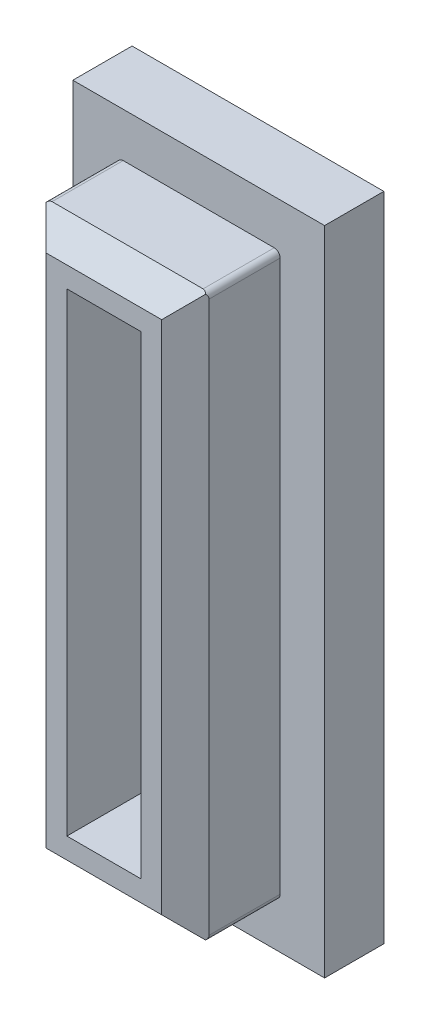
ISO-10303-21;
HEADER;
FILE_DESCRIPTION(('STEP AP214'),'2;1');
FILE_NAME('part.step','',(''),(''),'','','');
FILE_SCHEMA(('AUTOMOTIVE_DESIGN { 1 0 10303 214 1 1 1 1 }'));
ENDSEC;
DATA;
#1=APPLICATION_CONTEXT('core data for automotive mechanical design processes');
#2=APPLICATION_PROTOCOL_DEFINITION('international standard','automotive_design',2000,#1);
#3=PRODUCT_CONTEXT('',#1,'mechanical');
#4=PRODUCT('Part','Part','',(#3));
#5=PRODUCT_RELATED_PRODUCT_CATEGORY('part','',(#4));
#6=PRODUCT_DEFINITION_FORMATION('','',#4);
#7=PRODUCT_DEFINITION_CONTEXT('part definition',#1,'design');
#8=PRODUCT_DEFINITION('design','',#6,#7);
#9=PRODUCT_DEFINITION_SHAPE('','',#8);
#10=(LENGTH_UNIT() NAMED_UNIT(*) SI_UNIT(.MILLI.,.METRE.));
#11=(NAMED_UNIT(*) PLANE_ANGLE_UNIT() SI_UNIT($,.RADIAN.));
#12=(NAMED_UNIT(*) SI_UNIT($,.STERADIAN.) SOLID_ANGLE_UNIT());
#13=UNCERTAINTY_MEASURE_WITH_UNIT(LENGTH_MEASURE(1.E-05),#10,'distance_accuracy_value','');
#14=(GEOMETRIC_REPRESENTATION_CONTEXT(3) GLOBAL_UNCERTAINTY_ASSIGNED_CONTEXT((#13)) GLOBAL_UNIT_ASSIGNED_CONTEXT((#10,
#11,#12)) REPRESENTATION_CONTEXT('',''));
#15=CARTESIAN_POINT('',(0.,0.,0.));
#16=DIRECTION('',(0.,0.,1.));
#17=DIRECTION('',(1.,0.,0.));
#18=AXIS2_PLACEMENT_3D('',#15,#16,#17);
#19=CARTESIAN_POINT('',(-12.7686327088267,2.33540172513786,0.));
#20=DIRECTION('',(0.,0.,1.));
#21=DIRECTION('',(1.,0.,0.));
#22=AXIS2_PLACEMENT_3D('',#19,#20,#21);
#23=PLANE('',#22);
#24=DIRECTION('',(1.,0.,0.));
#25=VECTOR('',#24,1.);
#26=CARTESIAN_POINT('',(-14.0186327088267,-5.66459827486215,0.));
#27=LINE('',#26,#25);
#28=CARTESIAN_POINT('',(-14.0186327088267,-5.66459827486215,0.));
#29=VERTEX_POINT('',#28);
#30=CARTESIAN_POINT('',(-11.5186327088267,-5.66459827486215,0.));
#31=VERTEX_POINT('',#30);
#32=EDGE_CURVE('E254',#29,#31,#27,.T.);
#33=ORIENTED_EDGE('',*,*,#32,.T.);
#34=DIRECTION('',(0.,1.,0.));
#35=VECTOR('',#34,1.);
#36=CARTESIAN_POINT('',(-11.5186327088267,-5.66459827486214,0.));
#37=LINE('',#36,#35);
#38=CARTESIAN_POINT('',(-11.5186327088267,10.3354017251379,0.));
#39=VERTEX_POINT('',#38);
#40=EDGE_CURVE('E255',#31,#39,#37,.T.);
#41=ORIENTED_EDGE('',*,*,#40,.T.);
#42=DIRECTION('',(-1.,0.,0.));
#43=VECTOR('',#42,1.);
#44=CARTESIAN_POINT('',(-11.5186327088267,10.3354017251379,0.));
#45=LINE('',#44,#43);
#46=CARTESIAN_POINT('',(-14.0186327088267,10.3354017251379,0.));
#47=VERTEX_POINT('',#46);
#48=EDGE_CURVE('E234',#39,#47,#45,.T.);
#49=ORIENTED_EDGE('',*,*,#48,.T.);
#50=DIRECTION('',(0.,-1.,0.));
#51=VECTOR('',#50,1.);
#52=CARTESIAN_POINT('',(-14.0186327088267,10.3354017251379,0.));
#53=LINE('',#52,#51);
#54=EDGE_CURVE('E382',#47,#29,#53,.T.);
#55=ORIENTED_EDGE('',*,*,#54,.T.);
#56=EDGE_LOOP('',(#33,#41,#49,#55));
#57=FACE_BOUND('',#56,.T.);
#58=DIRECTION('',(1.,0.,0.));
#59=VECTOR('',#58,1.);
#60=CARTESIAN_POINT('',(-17.0186327088267,-8.66459827486214,0.));
#61=LINE('',#60,#59);
#62=CARTESIAN_POINT('',(-17.0186327088267,-8.66459827486214,0.));
#63=VERTEX_POINT('',#62);
#64=CARTESIAN_POINT('',(-8.51863270882669,-8.66459827486214,0.));
#65=VERTEX_POINT('',#64);
#66=EDGE_CURVE('E11',#63,#65,#61,.T.);
#67=ORIENTED_EDGE('',*,*,#66,.F.);
#68=DIRECTION('',(0.,-1.,0.));
#69=VECTOR('',#68,1.);
#70=CARTESIAN_POINT('',(-17.0186327088267,13.3354017251379,0.));
#71=LINE('',#70,#69);
#72=CARTESIAN_POINT('',(-17.0186327088267,13.3354017251379,0.));
#73=VERTEX_POINT('',#72);
#74=EDGE_CURVE('E386',#73,#63,#71,.T.);
#75=ORIENTED_EDGE('',*,*,#74,.F.);
#76=DIRECTION('',(-1.,0.,0.));
#77=VECTOR('',#76,1.);
#78=CARTESIAN_POINT('',(-8.51863270882669,13.3354017251379,0.));
#79=LINE('',#78,#77);
#80=CARTESIAN_POINT('',(-8.51863270882669,13.3354017251379,0.));
#81=VERTEX_POINT('',#80);
#82=EDGE_CURVE('E366',#81,#73,#79,.T.);
#83=ORIENTED_EDGE('',*,*,#82,.F.);
#84=DIRECTION('',(0.,1.,0.));
#85=VECTOR('',#84,1.);
#86=CARTESIAN_POINT('',(-8.51863270882669,-8.66459827486214,0.));
#87=LINE('',#86,#85);
#88=EDGE_CURVE('E25',#65,#81,#87,.T.);
#89=ORIENTED_EDGE('',*,*,#88,.F.);
#90=EDGE_LOOP('',(#67,#75,#83,#89));
#91=FACE_BOUND('',#90,.T.);
#92=ADVANCED_FACE('F17',(#57,#91),#23,.F.);
#93=CARTESIAN_POINT('',(-8.51863270882669,-8.66459827486214,0.));
#94=DIRECTION('',(0.,-1.,0.));
#95=DIRECTION('',(0.,0.,-1.));
#96=AXIS2_PLACEMENT_3D('',#93,#94,#95);
#97=PLANE('',#96);
#98=DIRECTION('',(-1.,0.,0.));
#99=VECTOR('',#98,1.);
#100=CARTESIAN_POINT('',(-8.51863270882669,-8.66459827486214,2.));
#101=LINE('',#100,#99);
#102=CARTESIAN_POINT('',(-8.51863270882669,-8.66459827486214,2.));
#103=VERTEX_POINT('',#102);
#104=CARTESIAN_POINT('',(-17.0186327088267,-8.66459827486214,2.));
#105=VERTEX_POINT('',#104);
#106=EDGE_CURVE('E297',#103,#105,#101,.T.);
#107=ORIENTED_EDGE('',*,*,#106,.T.);
#108=DIRECTION('',(0.,0.,1.));
#109=VECTOR('',#108,1.);
#110=CARTESIAN_POINT('',(-17.0186327088267,-8.66459827486214,0.));
#111=LINE('',#110,#109);
#112=EDGE_CURVE('E409',#63,#105,#111,.T.);
#113=ORIENTED_EDGE('',*,*,#112,.F.);
#114=ORIENTED_EDGE('',*,*,#66,.T.);
#115=DIRECTION('',(0.,0.,1.));
#116=VECTOR('',#115,1.);
#117=CARTESIAN_POINT('',(-8.51863270882669,-8.66459827486214,0.));
#118=LINE('',#117,#116);
#119=EDGE_CURVE('E369',#65,#103,#118,.T.);
#120=ORIENTED_EDGE('',*,*,#119,.T.);
#121=EDGE_LOOP('',(#107,#113,#114,#120));
#122=FACE_BOUND('',#121,.T.);
#123=ADVANCED_FACE('F801',(#122),#97,.T.);
#124=CARTESIAN_POINT('',(-8.51863270882669,13.3354017251379,0.));
#125=DIRECTION('',(1.,0.,0.));
#126=DIRECTION('',(0.,1.,0.));
#127=AXIS2_PLACEMENT_3D('',#124,#125,#126);
#128=PLANE('',#127);
#129=DIRECTION('',(0.,-1.,0.));
#130=VECTOR('',#129,1.);
#131=CARTESIAN_POINT('',(-8.51863270882669,13.3354017251379,2.));
#132=LINE('',#131,#130);
#133=CARTESIAN_POINT('',(-8.51863270882669,13.3354017251379,2.));
#134=VERTEX_POINT('',#133);
#135=EDGE_CURVE('E301',#134,#103,#132,.T.);
#136=ORIENTED_EDGE('',*,*,#135,.T.);
#137=ORIENTED_EDGE('',*,*,#119,.F.);
#138=ORIENTED_EDGE('',*,*,#88,.T.);
#139=DIRECTION('',(0.,0.,1.));
#140=VECTOR('',#139,1.);
#141=CARTESIAN_POINT('',(-8.51863270882669,13.3354017251379,0.));
#142=LINE('',#141,#140);
#143=EDGE_CURVE('E370',#81,#134,#142,.T.);
#144=ORIENTED_EDGE('',*,*,#143,.T.);
#145=EDGE_LOOP('',(#136,#137,#138,#144));
#146=FACE_BOUND('',#145,.T.);
#147=ADVANCED_FACE('F792',(#146),#128,.T.);
#148=CARTESIAN_POINT('',(-17.0186327088267,13.3354017251379,0.));
#149=DIRECTION('',(0.,1.,0.));
#150=DIRECTION('',(1.,0.,0.));
#151=AXIS2_PLACEMENT_3D('',#148,#149,#150);
#152=PLANE('',#151);
#153=DIRECTION('',(1.,0.,0.));
#154=VECTOR('',#153,1.);
#155=CARTESIAN_POINT('',(-17.0186327088267,13.3354017251379,2.));
#156=LINE('',#155,#154);
#157=CARTESIAN_POINT('',(-17.0186327088267,13.3354017251379,2.));
#158=VERTEX_POINT('',#157);
#159=EDGE_CURVE('E363',#158,#134,#156,.T.);
#160=ORIENTED_EDGE('',*,*,#159,.T.);
#161=ORIENTED_EDGE('',*,*,#143,.F.);
#162=ORIENTED_EDGE('',*,*,#82,.T.);
#163=DIRECTION('',(0.,0.,1.));
#164=VECTOR('',#163,1.);
#165=CARTESIAN_POINT('',(-17.0186327088267,13.3354017251379,0.));
#166=LINE('',#165,#164);
#167=EDGE_CURVE('E383',#73,#158,#166,.T.);
#168=ORIENTED_EDGE('',*,*,#167,.T.);
#169=EDGE_LOOP('',(#160,#161,#162,#168));
#170=FACE_BOUND('',#169,.T.);
#171=ADVANCED_FACE('F783',(#170),#152,.T.);
#172=CARTESIAN_POINT('',(-17.0186327088267,-8.66459827486214,0.));
#173=DIRECTION('',(-1.,0.,0.));
#174=DIRECTION('',(0.,0.,1.));
#175=AXIS2_PLACEMENT_3D('',#172,#173,#174);
#176=PLANE('',#175);
#177=DIRECTION('',(0.,1.,0.));
#178=VECTOR('',#177,1.);
#179=CARTESIAN_POINT('',(-17.0186327088267,-8.66459827486214,2.));
#180=LINE('',#179,#178);
#181=EDGE_CURVE('E249',#105,#158,#180,.T.);
#182=ORIENTED_EDGE('',*,*,#181,.T.);
#183=ORIENTED_EDGE('',*,*,#167,.F.);
#184=ORIENTED_EDGE('',*,*,#74,.T.);
#185=ORIENTED_EDGE('',*,*,#112,.T.);
#186=EDGE_LOOP('',(#182,#183,#184,#185));
#187=FACE_BOUND('',#186,.T.);
#188=ADVANCED_FACE('F774',(#187),#176,.T.);
#189=CARTESIAN_POINT('',(-12.7686327088267,2.33540172513786,2.));
#190=DIRECTION('',(0.,0.,1.));
#191=DIRECTION('',(1.,0.,0.));
#192=AXIS2_PLACEMENT_3D('',#189,#190,#191);
#193=PLANE('',#192);
#194=DIRECTION('',(0.,1.,0.));
#195=VECTOR('',#194,1.);
#196=CARTESIAN_POINT('',(-15.5186327088267,-6.96459827486214,2.));
#197=LINE('',#196,#195);
#198=CARTESIAN_POINT('',(-15.5186327088267,-6.96459827486214,2.));
#199=VERTEX_POINT('',#198);
#200=CARTESIAN_POINT('',(-15.5186327088267,11.6354017251379,2.));
#201=VERTEX_POINT('',#200);
#202=EDGE_CURVE('E357',#199,#201,#197,.T.);
#203=ORIENTED_EDGE('',*,*,#202,.T.);
#204=CARTESIAN_POINT('',(-15.3186327088267,11.6354017251379,2.));
#205=DIRECTION('',(0.,0.,-1.));
#206=DIRECTION('',(0.,1.,0.));
#207=AXIS2_PLACEMENT_3D('',#204,#205,#206);
#208=CIRCLE('',#207,0.2);
#209=CARTESIAN_POINT('',(-15.3186327088267,11.8354017251378,2.));
#210=VERTEX_POINT('',#209);
#211=EDGE_CURVE('E323',#201,#210,#208,.T.);
#212=ORIENTED_EDGE('',*,*,#211,.T.);
#213=DIRECTION('',(1.,-4.412331E-12,0.));
#214=VECTOR('',#213,1.);
#215=CARTESIAN_POINT('',(-15.3186327088267,11.8354017251378,2.));
#216=LINE('',#215,#214);
#217=CARTESIAN_POINT('',(-10.2186327088267,11.8354017251153,2.));
#218=VERTEX_POINT('',#217);
#219=EDGE_CURVE('E250',#210,#218,#216,.T.);
#220=ORIENTED_EDGE('',*,*,#219,.T.);
#221=CARTESIAN_POINT('',(-10.2186327087862,11.6354017250974,2.));
#222=DIRECTION('',(0.,0.,-1.));
#223=DIRECTION('',(1.,2.023048E-10,0.));
#224=AXIS2_PLACEMENT_3D('',#221,#222,#223);
#225=CIRCLE('',#224,0.200000000017937);
#226=CARTESIAN_POINT('',(-10.0186327087683,11.6354017251379,2.));
#227=VERTEX_POINT('',#226);
#228=EDGE_CURVE('E207',#218,#227,#225,.T.);
#229=ORIENTED_EDGE('',*,*,#228,.T.);
#230=DIRECTION('',(-3.14014E-12,-1.,0.));
#231=VECTOR('',#230,1.);
#232=CARTESIAN_POINT('',(-10.0186327087683,11.6354017251379,2.));
#233=LINE('',#232,#231);
#234=CARTESIAN_POINT('',(-10.0186327088267,-6.96459827486214,2.));
#235=VERTEX_POINT('',#234);
#236=EDGE_CURVE('E202',#227,#235,#233,.T.);
#237=ORIENTED_EDGE('',*,*,#236,.T.);
#238=CARTESIAN_POINT('',(-10.2186327088267,-6.96459827486214,2.));
#239=DIRECTION('',(0.,0.,-1.));
#240=DIRECTION('',(0.,-1.,0.));
#241=AXIS2_PLACEMENT_3D('',#238,#239,#240);
#242=CIRCLE('',#241,0.199999999999989);
#243=CARTESIAN_POINT('',(-10.2186327088267,-7.16459827486213,2.));
#244=VERTEX_POINT('',#243);
#245=EDGE_CURVE('E245',#235,#244,#242,.T.);
#246=ORIENTED_EDGE('',*,*,#245,.T.);
#247=DIRECTION('',(-1.,0.,0.));
#248=VECTOR('',#247,1.);
#249=CARTESIAN_POINT('',(-10.2186327088267,-7.16459827486213,2.));
#250=LINE('',#249,#248);
#251=CARTESIAN_POINT('',(-15.3186327088267,-7.16459827486213,2.));
#252=VERTEX_POINT('',#251);
#253=EDGE_CURVE('E246',#244,#252,#250,.T.);
#254=ORIENTED_EDGE('',*,*,#253,.T.);
#255=CARTESIAN_POINT('',(-15.3186327086993,-6.96459827473478,2.));
#256=DIRECTION('',(0.,0.,-1.));
#257=DIRECTION('',(-1.,-6.368128E-10,0.));
#258=AXIS2_PLACEMENT_3D('',#255,#256,#257);
#259=CIRCLE('',#258,0.200000000127359);
#260=EDGE_CURVE('E265',#252,#199,#259,.T.);
#261=ORIENTED_EDGE('',*,*,#260,.T.);
#262=EDGE_LOOP('',(#203,#212,#220,#229,#237,#246,#254,#261));
#263=FACE_BOUND('',#262,.T.);
#264=ORIENTED_EDGE('',*,*,#181,.F.);
#265=ORIENTED_EDGE('',*,*,#106,.F.);
#266=ORIENTED_EDGE('',*,*,#135,.F.);
#267=ORIENTED_EDGE('',*,*,#159,.F.);
#268=EDGE_LOOP('',(#264,#265,#266,#267));
#269=FACE_BOUND('',#268,.T.);
#270=ADVANCED_FACE('F765',(#263,#269),#193,.T.);
#271=CARTESIAN_POINT('',(-10.2186327088267,-7.16459827486213,2.));
#272=DIRECTION('',(0.,-1.,0.));
#273=DIRECTION('',(0.,0.,-1.));
#274=AXIS2_PLACEMENT_3D('',#271,#272,#273);
#275=PLANE('',#274);
#276=DIRECTION('',(-1.,0.,-3.150769E-12));
#277=VECTOR('',#276,1.);
#278=CARTESIAN_POINT('',(-10.2186327088273,-7.16459827486213,4.40007018992266));
#279=LINE('',#278,#277);
#280=CARTESIAN_POINT('',(-10.2186327088273,-7.16459827486213,4.40007018992266));
#281=VERTEX_POINT('',#280);
#282=CARTESIAN_POINT('',(-15.3186327086999,-7.16459827484612,4.40007018992266));
#283=VERTEX_POINT('',#282);
#284=EDGE_CURVE('E349',#281,#283,#279,.T.);
#285=ORIENTED_EDGE('',*,*,#284,.T.);
#286=DIRECTION('',(0.,0.,1.));
#287=VECTOR('',#286,1.);
#288=CARTESIAN_POINT('',(-15.3186327088267,-7.16459827486213,2.));
#289=LINE('',#288,#287);
#290=EDGE_CURVE('E268',#252,#283,#289,.T.);
#291=ORIENTED_EDGE('',*,*,#290,.F.);
#292=ORIENTED_EDGE('',*,*,#253,.F.);
#293=DIRECTION('',(0.,0.,1.));
#294=VECTOR('',#293,1.);
#295=CARTESIAN_POINT('',(-10.2186327088267,-7.16459827486213,2.));
#296=LINE('',#295,#294);
#297=EDGE_CURVE('E293',#244,#281,#296,.T.);
#298=ORIENTED_EDGE('',*,*,#297,.T.);
#299=EDGE_LOOP('',(#285,#291,#292,#298));
#300=FACE_BOUND('',#299,.T.);
#301=ADVANCED_FACE('F713',(#300),#275,.T.);
#302=CARTESIAN_POINT('',(-15.3186327088267,11.8354017251378,2.));
#303=DIRECTION('',(4.412157E-12,1.,0.));
#304=DIRECTION('',(1.,-4.412157E-12,0.));
#305=AXIS2_PLACEMENT_3D('',#302,#303,#304);
#306=PLANE('',#305);
#307=DIRECTION('',(1.,-4.411983E-12,1.267831E-12));
#308=VECTOR('',#307,1.);
#309=CARTESIAN_POINT('',(-15.318632708826,11.8354017251378,4.40111772727568));
#310=LINE('',#309,#308);
#311=CARTESIAN_POINT('',(-15.318632708826,11.8354017251378,4.40111772727568));
#312=VERTEX_POINT('',#311);
#313=CARTESIAN_POINT('',(-10.2186327087856,11.8354017251218,4.40111772727568));
#314=VERTEX_POINT('',#313);
#315=EDGE_CURVE('E208',#312,#314,#310,.T.);
#316=ORIENTED_EDGE('',*,*,#315,.T.);
#317=DIRECTION('',(0.,0.,1.));
#318=VECTOR('',#317,1.);
#319=CARTESIAN_POINT('',(-10.2186327088267,11.8354017251153,2.));
#320=LINE('',#319,#318);
#321=EDGE_CURVE('E373',#218,#314,#320,.T.);
#322=ORIENTED_EDGE('',*,*,#321,.F.);
#323=ORIENTED_EDGE('',*,*,#219,.F.);
#324=DIRECTION('',(0.,0.,1.));
#325=VECTOR('',#324,1.);
#326=CARTESIAN_POINT('',(-15.3186327088267,11.8354017251378,2.));
#327=LINE('',#326,#325);
#328=EDGE_CURVE('E317',#210,#312,#327,.T.);
#329=ORIENTED_EDGE('',*,*,#328,.T.);
#330=EDGE_LOOP('',(#316,#322,#323,#329));
#331=FACE_BOUND('',#330,.T.);
#332=ADVANCED_FACE('F708',(#331),#306,.T.);
#333=CARTESIAN_POINT('',(-11.5186327088267,-5.66459827486215,2.));
#334=DIRECTION('',(0.,-1.,0.));
#335=DIRECTION('',(0.,0.,-1.));
#336=AXIS2_PLACEMENT_3D('',#333,#334,#335);
#337=PLANE('',#336);
#338=DIRECTION('',(-1.,0.,0.));
#339=VECTOR('',#338,1.);
#340=CARTESIAN_POINT('',(-11.5186327088267,-5.66459827486215,5.2));
#341=LINE('',#340,#339);
#342=CARTESIAN_POINT('',(-11.5186327088267,-5.66459827486215,5.2));
#343=VERTEX_POINT('',#342);
#344=CARTESIAN_POINT('',(-14.0186327088267,-5.66459827486215,5.2));
#345=VERTEX_POINT('',#344);
#346=EDGE_CURVE('E312',#343,#345,#341,.T.);
#347=ORIENTED_EDGE('',*,*,#346,.F.);
#348=DIRECTION('',(0.,0.,1.));
#349=VECTOR('',#348,1.);
#350=CARTESIAN_POINT('',(-11.5186327088267,-5.66459827486215,0.));
#351=LINE('',#350,#349);
#352=EDGE_CURVE('E251',#31,#343,#351,.T.);
#353=ORIENTED_EDGE('',*,*,#352,.F.);
#354=ORIENTED_EDGE('',*,*,#32,.F.);
#355=DIRECTION('',(0.,0.,-1.));
#356=VECTOR('',#355,1.);
#357=CARTESIAN_POINT('',(-14.0186327088267,-5.66459827486215,5.2));
#358=LINE('',#357,#356);
#359=EDGE_CURVE('E378',#345,#29,#358,.T.);
#360=ORIENTED_EDGE('',*,*,#359,.F.);
#361=EDGE_LOOP('',(#347,#353,#354,#360));
#362=FACE_BOUND('',#361,.T.);
#363=ADVANCED_FACE('F687',(#362),#337,.F.);
#364=CARTESIAN_POINT('',(-11.5186327088267,10.3354017251379,2.));
#365=DIRECTION('',(1.,0.,0.));
#366=DIRECTION('',(0.,1.,0.));
#367=AXIS2_PLACEMENT_3D('',#364,#365,#366);
#368=PLANE('',#367);
#369=DIRECTION('',(0.,-1.,0.));
#370=VECTOR('',#369,1.);
#371=CARTESIAN_POINT('',(-11.5186327088267,10.3354017251379,5.2));
#372=LINE('',#371,#370);
#373=CARTESIAN_POINT('',(-11.5186327088267,10.3354017251379,5.2));
#374=VERTEX_POINT('',#373);
#375=EDGE_CURVE('E308',#374,#343,#372,.T.);
#376=ORIENTED_EDGE('',*,*,#375,.F.);
#377=DIRECTION('',(0.,0.,1.));
#378=VECTOR('',#377,1.);
#379=CARTESIAN_POINT('',(-11.5186327088267,10.3354017251379,0.));
#380=LINE('',#379,#378);
#381=EDGE_CURVE('E389',#39,#374,#380,.T.);
#382=ORIENTED_EDGE('',*,*,#381,.F.);
#383=ORIENTED_EDGE('',*,*,#40,.F.);
#384=ORIENTED_EDGE('',*,*,#352,.T.);
#385=EDGE_LOOP('',(#376,#382,#383,#384));
#386=FACE_BOUND('',#385,.T.);
#387=ADVANCED_FACE('F681',(#386),#368,.F.);
#388=CARTESIAN_POINT('',(-14.0186327088267,10.3354017251379,2.));
#389=DIRECTION('',(0.,1.,0.));
#390=DIRECTION('',(1.,0.,0.));
#391=AXIS2_PLACEMENT_3D('',#388,#389,#390);
#392=PLANE('',#391);
#393=DIRECTION('',(1.,0.,0.));
#394=VECTOR('',#393,1.);
#395=CARTESIAN_POINT('',(-14.0186327088267,10.3354017251379,5.2));
#396=LINE('',#395,#394);
#397=CARTESIAN_POINT('',(-14.0186327088267,10.3354017251379,5.2));
#398=VERTEX_POINT('',#397);
#399=EDGE_CURVE('E313',#398,#374,#396,.T.);
#400=ORIENTED_EDGE('',*,*,#399,.F.);
#401=DIRECTION('',(0.,0.,1.));
#402=VECTOR('',#401,1.);
#403=CARTESIAN_POINT('',(-14.0186327088267,10.3354017251379,0.));
#404=LINE('',#403,#402);
#405=EDGE_CURVE('E393',#47,#398,#404,.T.);
#406=ORIENTED_EDGE('',*,*,#405,.F.);
#407=ORIENTED_EDGE('',*,*,#48,.F.);
#408=ORIENTED_EDGE('',*,*,#381,.T.);
#409=EDGE_LOOP('',(#400,#406,#407,#408));
#410=FACE_BOUND('',#409,.T.);
#411=ADVANCED_FACE('F686',(#410),#392,.F.);
#412=CARTESIAN_POINT('',(-14.0186327088267,-5.66459827486215,2.));
#413=DIRECTION('',(-1.,0.,0.));
#414=DIRECTION('',(0.,0.,1.));
#415=AXIS2_PLACEMENT_3D('',#412,#413,#414);
#416=PLANE('',#415);
#417=DIRECTION('',(0.,1.,0.));
#418=VECTOR('',#417,1.);
#419=CARTESIAN_POINT('',(-14.0186327088267,-5.66459827486214,5.2));
#420=LINE('',#419,#418);
#421=EDGE_CURVE('E336',#345,#398,#420,.T.);
#422=ORIENTED_EDGE('',*,*,#421,.F.);
#423=ORIENTED_EDGE('',*,*,#359,.T.);
#424=ORIENTED_EDGE('',*,*,#54,.F.);
#425=ORIENTED_EDGE('',*,*,#405,.T.);
#426=EDGE_LOOP('',(#422,#423,#424,#425));
#427=FACE_BOUND('',#426,.T.);
#428=ADVANCED_FACE('F736',(#427),#416,.F.);
#429=CARTESIAN_POINT('',(-10.0186327087683,11.6354017251379,2.));
#430=DIRECTION('',(1.,-3.14014E-12,0.));
#431=DIRECTION('',(-3.14014E-12,-1.,0.));
#432=AXIS2_PLACEMENT_3D('',#429,#430,#431);
#433=PLANE('',#432);
#434=DIRECTION('',(-3.14014E-12,-1.,3.14014E-12));
#435=VECTOR('',#434,1.);
#436=CARTESIAN_POINT('',(-10.0186327087683,11.6354017250974,4.39999999994162));
#437=LINE('',#436,#435);
#438=CARTESIAN_POINT('',(-10.0186327088267,11.6354017250974,4.4));
#439=VERTEX_POINT('',#438);
#440=CARTESIAN_POINT('',(-10.0186327088267,-6.96459827486214,4.4));
#441=VERTEX_POINT('',#440);
#442=EDGE_CURVE('E200',#439,#441,#437,.T.);
#443=ORIENTED_EDGE('',*,*,#442,.T.);
#444=DIRECTION('',(0.,0.,1.));
#445=VECTOR('',#444,1.);
#446=CARTESIAN_POINT('',(-10.0186327088267,-6.96459827486214,2.));
#447=LINE('',#446,#445);
#448=EDGE_CURVE('E241',#235,#441,#447,.T.);
#449=ORIENTED_EDGE('',*,*,#448,.F.);
#450=ORIENTED_EDGE('',*,*,#236,.F.);
#451=DIRECTION('',(0.,0.,1.));
#452=VECTOR('',#451,1.);
#453=CARTESIAN_POINT('',(-10.0186327087683,11.6354017251379,2.));
#454=LINE('',#453,#452);
#455=EDGE_CURVE('E195',#227,#439,#454,.T.);
#456=ORIENTED_EDGE('',*,*,#455,.T.);
#457=EDGE_LOOP('',(#443,#449,#450,#456));
#458=FACE_BOUND('',#457,.T.);
#459=ADVANCED_FACE('F197',(#458),#433,.T.);
#460=CARTESIAN_POINT('',(-10.2186327087862,11.6354017250974,2.));
#461=DIRECTION('',(0.,0.,1.));
#462=DIRECTION('',(1.,2.023048E-10,0.));
#463=AXIS2_PLACEMENT_3D('',#460,#461,#462);
#464=CYLINDRICAL_SURFACE('',#463,0.200000000017937);
#465=CARTESIAN_POINT('',(-10.2186327087862,11.6354017250974,4.59999999995956));
#466=DIRECTION('',(-0.707106781186527,0.,-0.707106781186568));
#467=DIRECTION('',(0.707106781186568,1.430511E-10,-0.707106781186527));
#468=AXIS2_PLACEMENT_3D('',#465,#466,#467);
#469=ELLIPSE('',#468,0.282842712499977,0.200000000017937);
#470=CARTESIAN_POINT('',(-10.0776739274737,11.7772841481595,4.45904121864709));
#471=VERTEX_POINT('',#470);
#472=EDGE_CURVE('E211',#471,#439,#469,.T.);
#473=ORIENTED_EDGE('',*,*,#472,.T.);
#474=ORIENTED_EDGE('',*,*,#455,.F.);
#475=ORIENTED_EDGE('',*,*,#228,.F.);
#476=ORIENTED_EDGE('',*,*,#321,.T.);
#477=CARTESIAN_POINT('',(-10.2186327087862,11.6354017250974,4.60044982061638));
#478=DIRECTION('',(-2.216693E-12,-0.705923115633426,-0.708288468644236));
#479=DIRECTION('',(-1.432902E-10,0.708288468644236,-0.705923115633426));
#480=AXIS2_PLACEMENT_3D('',#477,#478,#479);
#481=ELLIPSE('',#480,0.28237082611378,0.200000000017937);
#482=EDGE_CURVE('E214',#314,#471,#481,.T.);
#483=ORIENTED_EDGE('',*,*,#482,.T.);
#484=EDGE_LOOP('',(#473,#474,#475,#476,#483));
#485=FACE_BOUND('',#484,.T.);
#486=ADVANCED_FACE('F212',(#485),#464,.T.);
#487=CARTESIAN_POINT('',(-10.0186327087702,11.0338426189752,5.2));
#488=DIRECTION('',(-2.216693E-12,-0.705923115633426,-0.708288468644236));
#489=DIRECTION('',(0.,-0.708288468644236,0.705923115633426));
#490=AXIS2_PLACEMENT_3D('',#487,#488,#489);
#491=PLANE('',#490);
#492=DIRECTION('',(0.576705423801894,0.578637804083864,-0.576705423801859));
#493=VECTOR('',#492,1.);
#494=CARTESIAN_POINT('',(-10.8186327088267,11.0338426189777,5.2));
#495=LINE('',#494,#493);
#496=CARTESIAN_POINT('',(-10.8186327088267,11.0338426189777,5.2));
#497=VERTEX_POINT('',#496);
#498=EDGE_CURVE('E219',#497,#471,#495,.T.);
#499=ORIENTED_EDGE('',*,*,#498,.T.);
#500=ORIENTED_EDGE('',*,*,#482,.F.);
#501=ORIENTED_EDGE('',*,*,#315,.F.);
#502=CARTESIAN_POINT('',(-15.3186327088267,11.6354017251379,4.60044982059201));
#503=DIRECTION('',(-2.216693E-12,-0.705923115633426,-0.708288468644236));
#504=DIRECTION('',(0.,0.708288468644236,-0.705923115633426));
#505=AXIS2_PLACEMENT_3D('',#502,#503,#504);
#506=ELLIPSE('',#505,0.282370826088456,0.2);
#507=CARTESIAN_POINT('',(-15.459591490166,11.7772841481627,4.45904121866072));
#508=VERTEX_POINT('',#507);
#509=EDGE_CURVE('E244',#508,#312,#506,.T.);
#510=ORIENTED_EDGE('',*,*,#509,.F.);
#511=DIRECTION('',(0.576705423800663,-0.578637804086284,0.576705423800662));
#512=VECTOR('',#511,1.);
#513=CARTESIAN_POINT('',(-15.459591490166,11.7772841481627,4.45904121866072));
#514=LINE('',#513,#512);
#515=CARTESIAN_POINT('',(-14.7186327088267,11.0338426189899,5.2));
#516=VERTEX_POINT('',#515);
#517=EDGE_CURVE('E260',#508,#516,#514,.T.);
#518=ORIENTED_EDGE('',*,*,#517,.T.);
#519=DIRECTION('',(-1.,3.140052E-12,0.));
#520=VECTOR('',#519,1.);
#521=CARTESIAN_POINT('',(-10.8186327088267,11.0338426189777,5.2));
#522=LINE('',#521,#520);
#523=EDGE_CURVE('E330',#497,#516,#522,.T.);
#524=ORIENTED_EDGE('',*,*,#523,.F.);
#525=EDGE_LOOP('',(#499,#500,#501,#510,#518,#524));
#526=FACE_BOUND('',#525,.T.);
#527=ADVANCED_FACE('F635',(#526),#491,.F.);
#528=CARTESIAN_POINT('',(-15.5186327088267,-6.96459827486214,2.));
#529=DIRECTION('',(-1.,0.,0.));
#530=DIRECTION('',(0.,0.,1.));
#531=AXIS2_PLACEMENT_3D('',#528,#529,#530);
#532=PLANE('',#531);
#533=DIRECTION('',(0.,1.,0.));
#534=VECTOR('',#533,1.);
#535=CARTESIAN_POINT('',(-15.5186327088267,-6.96459827473478,4.4));
#536=LINE('',#535,#534);
#537=CARTESIAN_POINT('',(-15.5186327088266,-6.96459827473478,4.4));
#538=VERTEX_POINT('',#537);
#539=CARTESIAN_POINT('',(-15.5186327088266,11.6354017251379,4.4));
#540=VERTEX_POINT('',#539);
#541=EDGE_CURVE('E236',#538,#540,#536,.T.);
#542=ORIENTED_EDGE('',*,*,#541,.T.);
#543=DIRECTION('',(0.,0.,1.));
#544=VECTOR('',#543,1.);
#545=CARTESIAN_POINT('',(-15.5186327088267,11.6354017251379,2.));
#546=LINE('',#545,#544);
#547=EDGE_CURVE('E327',#201,#540,#546,.T.);
#548=ORIENTED_EDGE('',*,*,#547,.F.);
#549=ORIENTED_EDGE('',*,*,#202,.F.);
#550=DIRECTION('',(0.,0.,1.));
#551=VECTOR('',#550,1.);
#552=CARTESIAN_POINT('',(-15.5186327088267,-6.96459827486214,2.));
#553=LINE('',#552,#551);
#554=EDGE_CURVE('E269',#199,#538,#553,.T.);
#555=ORIENTED_EDGE('',*,*,#554,.T.);
#556=EDGE_LOOP('',(#542,#548,#549,#555));
#557=FACE_BOUND('',#556,.T.);
#558=ADVANCED_FACE('F657',(#557),#532,.T.);
#559=CARTESIAN_POINT('',(-15.3186327086993,-6.96459827473478,2.));
#560=DIRECTION('',(0.,0.,1.));
#561=DIRECTION('',(-1.,-6.368128E-10,0.));
#562=AXIS2_PLACEMENT_3D('',#559,#560,#561);
#563=CYLINDRICAL_SURFACE('',#562,0.200000000127359);
#564=CARTESIAN_POINT('',(-15.3186327086993,-6.96459827473478,4.60000000012734));
#565=DIRECTION('',(0.707106781186548,0.,-0.707106781186548));
#566=DIRECTION('',(-0.707106781186548,-4.502947E-10,-0.707106781186548));
#567=AXIS2_PLACEMENT_3D('',#564,#565,#566);
#568=ELLIPSE('',#567,0.282842712654731,0.200000000127359);
#569=CARTESIAN_POINT('',(-15.4599209898259,-7.10615258111363,4.45871171900076));
#570=VERTEX_POINT('',#569);
#571=EDGE_CURVE('E238',#570,#538,#568,.T.);
#572=ORIENTED_EDGE('',*,*,#571,.T.);
#573=ORIENTED_EDGE('',*,*,#554,.F.);
#574=ORIENTED_EDGE('',*,*,#260,.F.);
#575=ORIENTED_EDGE('',*,*,#290,.T.);
#576=CARTESIAN_POINT('',(-15.3186327086993,-6.96459827473478,4.60074033468849));
#577=DIRECTION('',(2.22411999999997E-12,0.708288468644236,-0.705923115633426));
#578=DIRECTION('',(4.495409E-10,-0.705923115633426,-0.708288468644236));
#579=AXIS2_PLACEMENT_3D('',#576,#577,#578);
#580=ELLIPSE('',#579,0.283316972766784,0.200000000127359);
#581=EDGE_CURVE('E346',#283,#570,#580,.T.);
#582=ORIENTED_EDGE('',*,*,#581,.T.);
#583=EDGE_LOOP('',(#572,#573,#574,#575,#582));
#584=FACE_BOUND('',#583,.T.);
#585=ADVANCED_FACE('F675',(#584),#563,.T.);
#586=CARTESIAN_POINT('',(-10.0186327088273,-7.16459827486276,4.40007018992266));
#587=DIRECTION('',(2.22412E-12,0.708288468644236,-0.705923115633426));
#588=DIRECTION('',(-1.,0.,-3.15065472534399E-12));
#589=AXIS2_PLACEMENT_3D('',#586,#587,#588);
#590=PLANE('',#589);
#591=DIRECTION('',(-0.577992961099134,0.576062734291803,0.577992961099101));
#592=VECTOR('',#591,1.);
#593=CARTESIAN_POINT('',(-10.0773444277757,-7.10615258118208,4.45871171894904));
#594=LINE('',#593,#592);
#595=CARTESIAN_POINT('',(-10.0773444277757,-7.10615258118208,4.45871171894904));
#596=VERTEX_POINT('',#595);
#597=CARTESIAN_POINT('',(-10.8186327088267,-6.36733985711595,5.2));
#598=VERTEX_POINT('',#597);
#599=EDGE_CURVE('E273',#596,#598,#594,.T.);
#600=ORIENTED_EDGE('',*,*,#599,.T.);
#601=DIRECTION('',(1.,-3.140052E-12,0.));
#602=VECTOR('',#601,1.);
#603=CARTESIAN_POINT('',(-14.7186327088267,-6.36733985710368,5.2));
#604=LINE('',#603,#602);
#605=CARTESIAN_POINT('',(-14.7186327088266,-6.36733985710366,5.2));
#606=VERTEX_POINT('',#605);
#607=EDGE_CURVE('E333',#606,#598,#604,.T.);
#608=ORIENTED_EDGE('',*,*,#607,.F.);
#609=DIRECTION('',(-0.57799296110032,-0.576062734289389,-0.57799296110032));
#610=VECTOR('',#609,1.);
#611=CARTESIAN_POINT('',(-14.7186327088266,-6.36733985710366,5.2));
#612=LINE('',#611,#610);
#613=EDGE_CURVE('E261',#606,#570,#612,.T.);
#614=ORIENTED_EDGE('',*,*,#613,.T.);
#615=ORIENTED_EDGE('',*,*,#581,.F.);
#616=ORIENTED_EDGE('',*,*,#284,.F.);
#617=CARTESIAN_POINT('',(-10.2186327088267,-6.96459827486214,4.60074033457677));
#618=DIRECTION('',(2.22412E-12,0.708288468644236,-0.705923115633426));
#619=DIRECTION('',(0.,-0.705923115633426,-0.708288468644236));
#620=AXIS2_PLACEMENT_3D('',#617,#618,#619);
#621=ELLIPSE('',#620,0.283316972586354,0.199999999999989);
#622=EDGE_CURVE('E289',#596,#281,#621,.T.);
#623=ORIENTED_EDGE('',*,*,#622,.F.);
#624=EDGE_LOOP('',(#600,#608,#614,#615,#616,#623));
#625=FACE_BOUND('',#624,.T.);
#626=ADVANCED_FACE('F670',(#625),#590,.F.);
#627=CARTESIAN_POINT('',(-12.7686327088077,-6.81171731230297,5.2));
#628=DIRECTION('',(0.,0.,1.));
#629=DIRECTION('',(1.,0.,0.));
#630=AXIS2_PLACEMENT_3D('',#627,#628,#629);
#631=PLANE('',#630);
#632=ORIENTED_EDGE('',*,*,#421,.T.);
#633=ORIENTED_EDGE('',*,*,#399,.T.);
#634=ORIENTED_EDGE('',*,*,#375,.T.);
#635=ORIENTED_EDGE('',*,*,#346,.T.);
#636=EDGE_LOOP('',(#632,#633,#634,#635));
#637=FACE_BOUND('',#636,.T.);
#638=DIRECTION('',(0.,1.,0.));
#639=VECTOR('',#638,1.);
#640=CARTESIAN_POINT('',(-10.8186327088267,-6.36733985711595,5.2));
#641=LINE('',#640,#639);
#642=EDGE_CURVE('E264',#598,#497,#641,.T.);
#643=ORIENTED_EDGE('',*,*,#642,.T.);
#644=ORIENTED_EDGE('',*,*,#523,.T.);
#645=DIRECTION('',(0.,-1.,0.));
#646=VECTOR('',#645,1.);
#647=CARTESIAN_POINT('',(-14.7186327088267,11.0338426189899,5.2));
#648=LINE('',#647,#646);
#649=EDGE_CURVE('E256',#516,#606,#648,.T.);
#650=ORIENTED_EDGE('',*,*,#649,.T.);
#651=ORIENTED_EDGE('',*,*,#607,.T.);
#652=EDGE_LOOP('',(#643,#644,#650,#651));
#653=FACE_BOUND('',#652,.T.);
#654=ADVANCED_FACE('F647',(#637,#653),#631,.T.);
#655=CARTESIAN_POINT('',(-15.3186327088267,11.6354017251379,2.));
#656=DIRECTION('',(0.,0.,1.));
#657=DIRECTION('',(0.,1.,0.));
#658=AXIS2_PLACEMENT_3D('',#655,#656,#657);
#659=CYLINDRICAL_SURFACE('',#658,0.2);
#660=CARTESIAN_POINT('',(-15.3186327088267,11.6354017251379,4.6));
#661=DIRECTION('',(0.707106781186548,0.,-0.707106781186548));
#662=DIRECTION('',(-0.707106781186548,0.,-0.707106781186548));
#663=AXIS2_PLACEMENT_3D('',#660,#661,#662);
#664=ELLIPSE('',#663,0.282842712474619,0.2);
#665=EDGE_CURVE('E239',#540,#508,#664,.T.);
#666=ORIENTED_EDGE('',*,*,#665,.T.);
#667=ORIENTED_EDGE('',*,*,#509,.T.);
#668=ORIENTED_EDGE('',*,*,#328,.F.);
#669=ORIENTED_EDGE('',*,*,#211,.F.);
#670=ORIENTED_EDGE('',*,*,#547,.T.);
#671=EDGE_LOOP('',(#666,#667,#668,#669,#670));
#672=FACE_BOUND('',#671,.T.);
#673=ADVANCED_FACE('F641',(#672),#659,.T.);
#674=CARTESIAN_POINT('',(-10.2186327088267,-6.96459827486214,2.));
#675=DIRECTION('',(0.,0.,1.));
#676=DIRECTION('',(0.,-1.,0.));
#677=AXIS2_PLACEMENT_3D('',#674,#675,#676);
#678=CYLINDRICAL_SURFACE('',#677,0.199999999999989);
#679=CARTESIAN_POINT('',(-10.2186327088267,-6.96459827486214,4.6));
#680=DIRECTION('',(-0.707106781186527,0.,-0.707106781186568));
#681=DIRECTION('',(0.707106781186568,0.,-0.707106781186527));
#682=AXIS2_PLACEMENT_3D('',#679,#680,#681);
#683=ELLIPSE('',#682,0.282842712474595,0.199999999999989);
#684=EDGE_CURVE('E224',#441,#596,#683,.T.);
#685=ORIENTED_EDGE('',*,*,#684,.T.);
#686=ORIENTED_EDGE('',*,*,#622,.T.);
#687=ORIENTED_EDGE('',*,*,#297,.F.);
#688=ORIENTED_EDGE('',*,*,#245,.F.);
#689=ORIENTED_EDGE('',*,*,#448,.T.);
#690=EDGE_LOOP('',(#685,#686,#687,#688,#689));
#691=FACE_BOUND('',#690,.T.);
#692=ADVANCED_FACE('F646',(#691),#678,.T.);
#693=CARTESIAN_POINT('',(-15.4600540650766,-8.66459827486214,4.45857864375004));
#694=DIRECTION('',(0.707106781186548,0.,-0.707106781186548));
#695=DIRECTION('',(0.,-1.,0.));
#696=AXIS2_PLACEMENT_3D('',#693,#694,#695);
#697=PLANE('',#696);
#698=ORIENTED_EDGE('',*,*,#665,.F.);
#699=ORIENTED_EDGE('',*,*,#541,.F.);
#700=ORIENTED_EDGE('',*,*,#571,.F.);
#701=ORIENTED_EDGE('',*,*,#613,.F.);
#702=ORIENTED_EDGE('',*,*,#649,.F.);
#703=ORIENTED_EDGE('',*,*,#517,.F.);
#704=EDGE_LOOP('',(#698,#699,#700,#701,#702,#703));
#705=FACE_BOUND('',#704,.T.);
#706=ADVANCED_FACE('F626',(#705),#697,.F.);
#707=CARTESIAN_POINT('',(-10.0772113526267,-8.66459827486214,4.4585786438));
#708=DIRECTION('',(-0.707106781186527,0.,-0.707106781186568));
#709=DIRECTION('',(-0.707106781186568,0.,0.707106781186527));
#710=AXIS2_PLACEMENT_3D('',#707,#708,#709);
#711=PLANE('',#710);
#712=ORIENTED_EDGE('',*,*,#684,.F.);
#713=ORIENTED_EDGE('',*,*,#442,.F.);
#714=ORIENTED_EDGE('',*,*,#472,.F.);
#715=ORIENTED_EDGE('',*,*,#498,.F.);
#716=ORIENTED_EDGE('',*,*,#642,.F.);
#717=ORIENTED_EDGE('',*,*,#599,.F.);
#718=EDGE_LOOP('',(#712,#713,#714,#715,#716,#717));
#719=FACE_BOUND('',#718,.T.);
#720=ADVANCED_FACE('F221',(#719),#711,.F.);
#721=CLOSED_SHELL('',(#92,#123,#147,#171,#188,#270,#301,#332,#363,#387,#411,#428,#459,#486,#527,
#558,#585,#626,#654,#673,#692,#706,#720));
#722=MANIFOLD_SOLID_BREP('B1',#721);
#723=ADVANCED_BREP_SHAPE_REPRESENTATION('',(#18,#722),#14);
#724=SHAPE_DEFINITION_REPRESENTATION(#9,#723);
ENDSEC;
END-ISO-10303-21;
